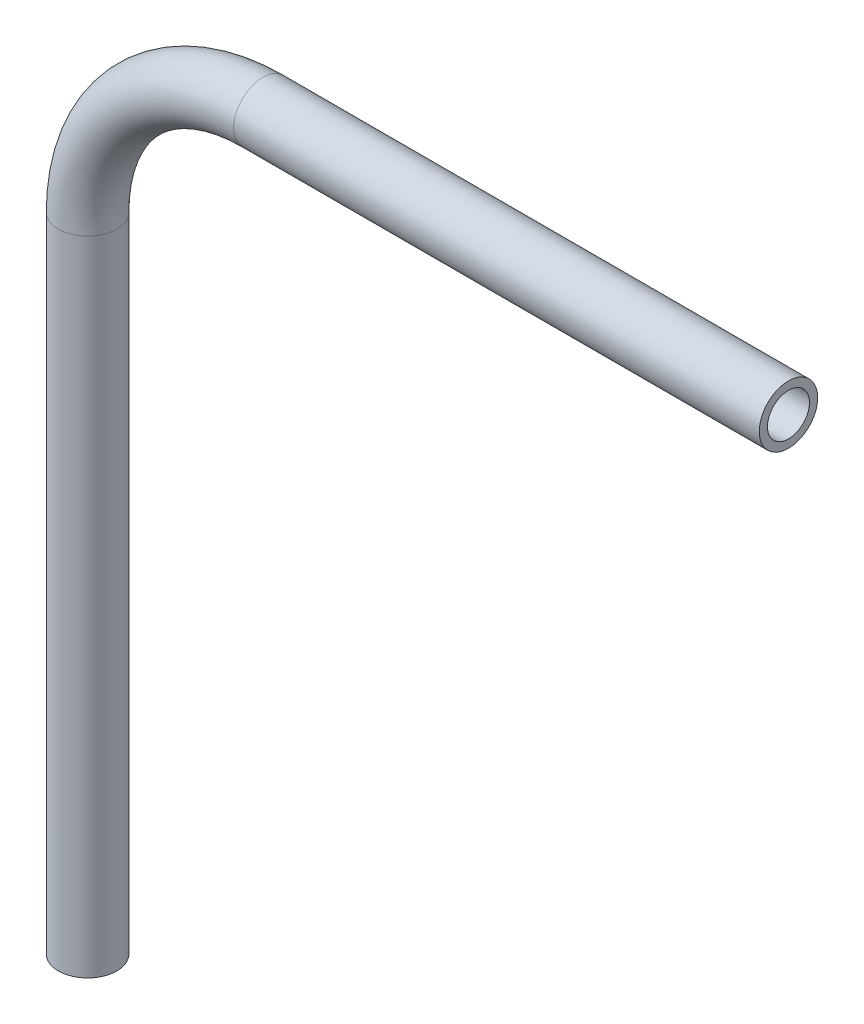
ISO-10303-21;
HEADER;
FILE_DESCRIPTION(('STEP AP214'),'2;1');
FILE_NAME('part.step','',(''),(''),'','','');
FILE_SCHEMA(('AUTOMOTIVE_DESIGN { 1 0 10303 214 1 1 1 1 }'));
ENDSEC;
DATA;
#1=APPLICATION_CONTEXT('core data for automotive mechanical design processes');
#2=APPLICATION_PROTOCOL_DEFINITION('international standard','automotive_design',2000,#1);
#3=PRODUCT_CONTEXT('',#1,'mechanical');
#4=PRODUCT('Part','Part','',(#3));
#5=PRODUCT_RELATED_PRODUCT_CATEGORY('part','',(#4));
#6=PRODUCT_DEFINITION_FORMATION('','',#4);
#7=PRODUCT_DEFINITION_CONTEXT('part definition',#1,'design');
#8=PRODUCT_DEFINITION('design','',#6,#7);
#9=PRODUCT_DEFINITION_SHAPE('','',#8);
#10=(LENGTH_UNIT() NAMED_UNIT(*) SI_UNIT(.MILLI.,.METRE.));
#11=(NAMED_UNIT(*) PLANE_ANGLE_UNIT() SI_UNIT($,.RADIAN.));
#12=(NAMED_UNIT(*) SI_UNIT($,.STERADIAN.) SOLID_ANGLE_UNIT());
#13=UNCERTAINTY_MEASURE_WITH_UNIT(LENGTH_MEASURE(1.E-05),#10,'distance_accuracy_value','');
#14=(GEOMETRIC_REPRESENTATION_CONTEXT(3) GLOBAL_UNCERTAINTY_ASSIGNED_CONTEXT((#13)) GLOBAL_UNIT_ASSIGNED_CONTEXT((#10,
#11,#12)) REPRESENTATION_CONTEXT('',''));
#15=CARTESIAN_POINT('',(0.,0.,0.));
#16=DIRECTION('',(0.,0.,1.));
#17=DIRECTION('',(1.,0.,0.));
#18=AXIS2_PLACEMENT_3D('',#15,#16,#17);
#19=CARTESIAN_POINT('',(0.,-71.3723178807947,0.));
#20=DIRECTION('',(0.,1.,0.));
#21=DIRECTION('',(0.,0.,1.));
#22=AXIS2_PLACEMENT_3D('',#19,#20,#21);
#23=CYLINDRICAL_SURFACE('',#22,3.175);
#24=CARTESIAN_POINT('',(0.,-1.52231788079483,0.));
#25=DIRECTION('',(0.,1.,0.));
#26=DIRECTION('',(0.,0.,-1.));
#27=AXIS2_PLACEMENT_3D('',#24,#25,#26);
#28=CIRCLE('',#27,3.175);
#29=CARTESIAN_POINT('',(-3.175,-1.52231788079486,0.));
#30=VERTEX_POINT('',#29);
#31=EDGE_CURVE('E79',#30,#30,#28,.T.);
#32=ORIENTED_EDGE('',*,*,#31,.F.);
#33=EDGE_LOOP('',(#32));
#34=FACE_BOUND('',#33,.T.);
#35=CARTESIAN_POINT('',(0.,-71.3723178807947,0.));
#36=DIRECTION('',(0.,1.,0.));
#37=DIRECTION('',(0.,0.,-1.));
#38=AXIS2_PLACEMENT_3D('',#35,#36,#37);
#39=CIRCLE('',#38,3.175);
#40=CARTESIAN_POINT('',(0.,-71.3723178807947,-3.175));
#41=VERTEX_POINT('',#40);
#42=EDGE_CURVE('E48',#41,#41,#39,.T.);
#43=ORIENTED_EDGE('',*,*,#42,.T.);
#44=EDGE_LOOP('',(#43));
#45=FACE_BOUND('',#44,.T.);
#46=ADVANCED_FACE('F33',(#34,#45),#23,.T.);
#47=CARTESIAN_POINT('',(19.05,-1.52231788079469,0.));
#48=DIRECTION('',(0.,0.,-1.));
#49=DIRECTION('',(-1.,0.,0.));
#50=AXIS2_PLACEMENT_3D('',#47,#48,#49);
#51=TOROIDAL_SURFACE('',#50,19.05,3.175);
#52=CARTESIAN_POINT('',(19.05,17.5276821192059,0.));
#53=DIRECTION('',(1.,0.,0.));
#54=DIRECTION('',(0.,0.,-1.));
#55=AXIS2_PLACEMENT_3D('',#52,#53,#54);
#56=CIRCLE('',#55,3.175);
#57=CARTESIAN_POINT('',(19.05,20.7026821192053,0.));
#58=VERTEX_POINT('',#57);
#59=EDGE_CURVE('E37',#58,#58,#56,.T.);
#60=CARTESIAN_POINT('',(19.05,-1.52231788079469,0.));
#61=DIRECTION('',(0.,0.,-1.));
#62=DIRECTION('',(-1.,0.,0.));
#63=AXIS2_PLACEMENT_3D('',#60,#61,#62);
#64=CIRCLE('',#63,22.225);
#65=EDGE_CURVE('',#30,#58,#64,.T.);
#66=ORIENTED_EDGE('',*,*,#31,.T.);
#67=ORIENTED_EDGE('',*,*,#59,.F.);
#68=ORIENTED_EDGE('',*,*,#65,.T.);
#69=ORIENTED_EDGE('',*,*,#65,.F.);
#70=EDGE_LOOP('',(#66,#68,#67,#69));
#71=FACE_BOUND('',#70,.T.);
#72=ADVANCED_FACE('F87',(#71),#51,.T.);
#73=CARTESIAN_POINT('',(19.0500000000001,17.5276821192053,0.));
#74=DIRECTION('',(1.,0.,0.));
#75=DIRECTION('',(0.,1.,0.));
#76=AXIS2_PLACEMENT_3D('',#73,#74,#75);
#77=CYLINDRICAL_SURFACE('',#76,3.175);
#78=CARTESIAN_POINT('',(76.2,17.5276821192053,0.));
#79=DIRECTION('',(1.,0.,0.));
#80=DIRECTION('',(0.,0.,-1.));
#81=AXIS2_PLACEMENT_3D('',#78,#79,#80);
#82=CIRCLE('',#81,3.175);
#83=CARTESIAN_POINT('',(76.2,17.5276821192053,-3.175));
#84=VERTEX_POINT('',#83);
#85=EDGE_CURVE('E53',#84,#84,#82,.T.);
#86=ORIENTED_EDGE('',*,*,#85,.F.);
#87=EDGE_LOOP('',(#86));
#88=FACE_BOUND('',#87,.T.);
#89=ORIENTED_EDGE('',*,*,#59,.T.);
#90=EDGE_LOOP('',(#89));
#91=FACE_BOUND('',#90,.T.);
#92=ADVANCED_FACE('F35',(#88,#91),#77,.T.);
#93=CARTESIAN_POINT('',(0.,-71.3723178807947,0.));
#94=DIRECTION('',(0.,1.,0.));
#95=DIRECTION('',(0.,0.,-1.));
#96=AXIS2_PLACEMENT_3D('',#93,#94,#95);
#97=PLANE('',#96);
#98=CARTESIAN_POINT('',(0.,-71.3723178807947,0.));
#99=DIRECTION('',(0.,1.,0.));
#100=DIRECTION('',(0.,0.,-1.));
#101=AXIS2_PLACEMENT_3D('',#98,#99,#100);
#102=CIRCLE('',#101,2.286);
#103=CARTESIAN_POINT('',(0.,-71.3723178807947,-2.286));
#104=VERTEX_POINT('',#103);
#105=EDGE_CURVE('E74',#104,#104,#102,.F.);
#106=ORIENTED_EDGE('',*,*,#105,.F.);
#107=EDGE_LOOP('',(#106));
#108=FACE_BOUND('',#107,.T.);
#109=ORIENTED_EDGE('',*,*,#42,.F.);
#110=EDGE_LOOP('',(#109));
#111=FACE_BOUND('',#110,.T.);
#112=ADVANCED_FACE('F93',(#108,#111),#97,.F.);
#113=CARTESIAN_POINT('',(76.2,17.5276821192053,0.));
#114=DIRECTION('',(1.,0.,0.));
#115=DIRECTION('',(0.,0.,-1.));
#116=AXIS2_PLACEMENT_3D('',#113,#114,#115);
#117=PLANE('',#116);
#118=CARTESIAN_POINT('',(76.2,17.5276821192053,0.));
#119=DIRECTION('',(1.,0.,0.));
#120=DIRECTION('',(0.,0.,-1.));
#121=AXIS2_PLACEMENT_3D('',#118,#119,#120);
#122=CIRCLE('',#121,2.286);
#123=CARTESIAN_POINT('',(76.2,17.5276821192053,-2.286));
#124=VERTEX_POINT('',#123);
#125=EDGE_CURVE('E11',#124,#124,#122,.F.);
#126=ORIENTED_EDGE('',*,*,#125,.T.);
#127=EDGE_LOOP('',(#126));
#128=FACE_BOUND('',#127,.T.);
#129=ORIENTED_EDGE('',*,*,#85,.T.);
#130=EDGE_LOOP('',(#129));
#131=FACE_BOUND('',#130,.T.);
#132=ADVANCED_FACE('F60',(#128,#131),#117,.T.);
#133=CARTESIAN_POINT('',(0.,-71.3723178807947,0.));
#134=DIRECTION('',(0.,1.,0.));
#135=DIRECTION('',(0.,0.,1.));
#136=AXIS2_PLACEMENT_3D('',#133,#134,#135);
#137=CYLINDRICAL_SURFACE('',#136,2.286);
#138=CARTESIAN_POINT('',(0.,-1.52231788079483,0.));
#139=DIRECTION('',(0.,1.,0.));
#140=DIRECTION('',(0.,0.,-1.));
#141=AXIS2_PLACEMENT_3D('',#138,#139,#140);
#142=CIRCLE('',#141,2.286);
#143=CARTESIAN_POINT('',(-2.286,-1.52231788079485,0.));
#144=VERTEX_POINT('',#143);
#145=EDGE_CURVE('E71',#144,#144,#142,.F.);
#146=ORIENTED_EDGE('',*,*,#145,.F.);
#147=EDGE_LOOP('',(#146));
#148=FACE_BOUND('',#147,.T.);
#149=ORIENTED_EDGE('',*,*,#105,.T.);
#150=EDGE_LOOP('',(#149));
#151=FACE_BOUND('',#150,.T.);
#152=ADVANCED_FACE('F101',(#148,#151),#137,.F.);
#153=CARTESIAN_POINT('',(19.05,-1.52231788079469,0.));
#154=DIRECTION('',(0.,0.,-1.));
#155=DIRECTION('',(-1.,0.,0.));
#156=AXIS2_PLACEMENT_3D('',#153,#154,#155);
#157=TOROIDAL_SURFACE('',#156,19.05,2.286);
#158=CARTESIAN_POINT('',(19.05,17.5276821192059,0.));
#159=DIRECTION('',(1.,0.,0.));
#160=DIRECTION('',(0.,0.,-1.));
#161=AXIS2_PLACEMENT_3D('',#158,#159,#160);
#162=CIRCLE('',#161,2.286);
#163=CARTESIAN_POINT('',(19.05,19.8136821192053,0.));
#164=VERTEX_POINT('',#163);
#165=EDGE_CURVE('E42',#164,#164,#162,.F.);
#166=CARTESIAN_POINT('',(19.05,-1.52231788079469,0.));
#167=DIRECTION('',(0.,0.,-1.));
#168=DIRECTION('',(-1.,0.,0.));
#169=AXIS2_PLACEMENT_3D('',#166,#167,#168);
#170=CIRCLE('',#169,21.336);
#171=EDGE_CURVE('',#144,#164,#170,.T.);
#172=ORIENTED_EDGE('',*,*,#145,.T.);
#173=ORIENTED_EDGE('',*,*,#165,.F.);
#174=ORIENTED_EDGE('',*,*,#171,.T.);
#175=ORIENTED_EDGE('',*,*,#171,.F.);
#176=EDGE_LOOP('',(#172,#174,#173,#175));
#177=FACE_BOUND('',#176,.T.);
#178=ADVANCED_FACE('F66',(#177),#157,.F.);
#179=CARTESIAN_POINT('',(19.0500000000001,17.5276821192053,0.));
#180=DIRECTION('',(1.,0.,0.));
#181=DIRECTION('',(0.,1.,0.));
#182=AXIS2_PLACEMENT_3D('',#179,#180,#181);
#183=CYLINDRICAL_SURFACE('',#182,2.286);
#184=ORIENTED_EDGE('',*,*,#125,.F.);
#185=EDGE_LOOP('',(#184));
#186=FACE_BOUND('',#185,.T.);
#187=ORIENTED_EDGE('',*,*,#165,.T.);
#188=EDGE_LOOP('',(#187));
#189=FACE_BOUND('',#188,.T.);
#190=ADVANCED_FACE('F63',(#186,#189),#183,.F.);
#191=CLOSED_SHELL('',(#46,#72,#92,#112,#132,#152,#178,#190));
#192=MANIFOLD_SOLID_BREP('B2',#191);
#193=ADVANCED_BREP_SHAPE_REPRESENTATION('',(#18,#192),#14);
#194=SHAPE_DEFINITION_REPRESENTATION(#9,#193);
ENDSEC;
END-ISO-10303-21;
